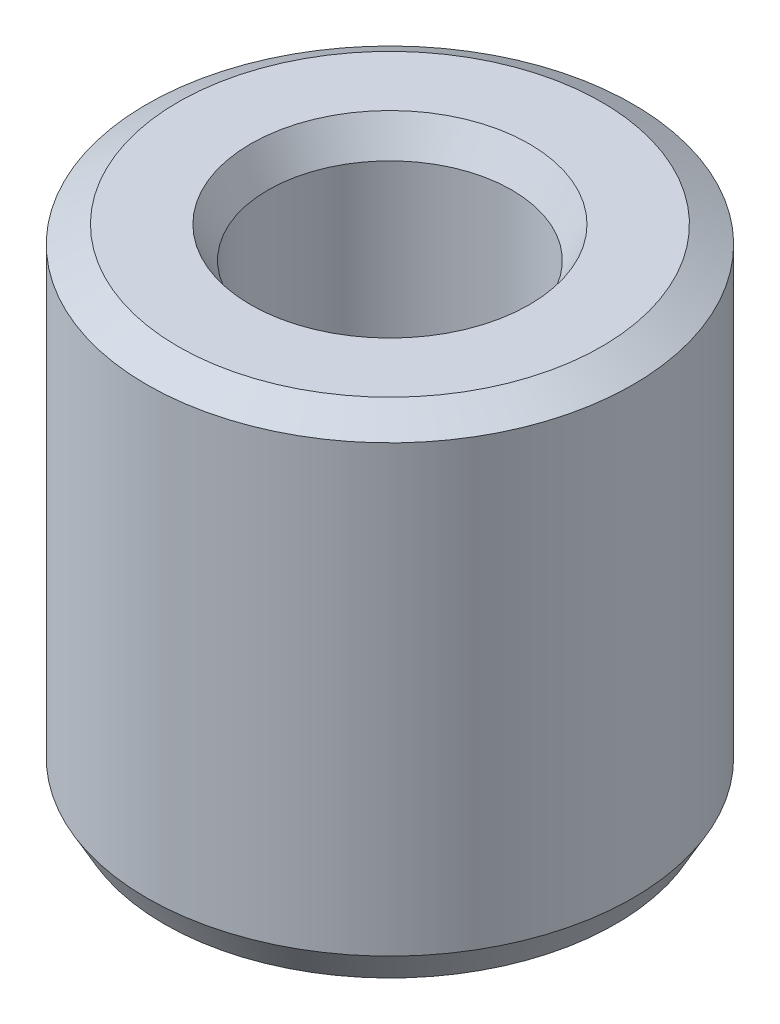
ISO-10303-21;
HEADER;
FILE_DESCRIPTION(('STEP AP214'),'2;1');
FILE_NAME('part.step','',(''),(''),'','','');
FILE_SCHEMA(('AUTOMOTIVE_DESIGN { 1 0 10303 214 1 1 1 1 }'));
ENDSEC;
DATA;
#1=APPLICATION_CONTEXT('core data for automotive mechanical design processes');
#2=APPLICATION_PROTOCOL_DEFINITION('international standard','automotive_design',2000,#1);
#3=PRODUCT_CONTEXT('',#1,'mechanical');
#4=PRODUCT('Part','Part','',(#3));
#5=PRODUCT_RELATED_PRODUCT_CATEGORY('part','',(#4));
#6=PRODUCT_DEFINITION_FORMATION('','',#4);
#7=PRODUCT_DEFINITION_CONTEXT('part definition',#1,'design');
#8=PRODUCT_DEFINITION('design','',#6,#7);
#9=PRODUCT_DEFINITION_SHAPE('','',#8);
#10=(LENGTH_UNIT() NAMED_UNIT(*) SI_UNIT(.MILLI.,.METRE.));
#11=(NAMED_UNIT(*) PLANE_ANGLE_UNIT() SI_UNIT($,.RADIAN.));
#12=(NAMED_UNIT(*) SI_UNIT($,.STERADIAN.) SOLID_ANGLE_UNIT());
#13=UNCERTAINTY_MEASURE_WITH_UNIT(LENGTH_MEASURE(1.E-05),#10,'distance_accuracy_value','');
#14=(GEOMETRIC_REPRESENTATION_CONTEXT(3) GLOBAL_UNCERTAINTY_ASSIGNED_CONTEXT((#13)) GLOBAL_UNIT_ASSIGNED_CONTEXT((#10,
#11,#12)) REPRESENTATION_CONTEXT('',''));
#15=CARTESIAN_POINT('',(0.,0.,0.));
#16=DIRECTION('',(0.,0.,1.));
#17=DIRECTION('',(1.,0.,0.));
#18=AXIS2_PLACEMENT_3D('',#15,#16,#17);
#19=CARTESIAN_POINT('',(0.,101.469136186512,0.));
#20=DIRECTION('',(0.,-1.,0.));
#21=DIRECTION('',(0.,0.,-1.));
#22=AXIS2_PLACEMENT_3D('',#19,#20,#21);
#23=CYLINDRICAL_SURFACE('',#22,50.);
#24=CARTESIAN_POINT('',(0.,6.42921951662753,0.));
#25=DIRECTION('',(0.,1.,0.));
#26=DIRECTION('',(0.,0.,1.));
#27=AXIS2_PLACEMENT_3D('',#24,#25,#26);
#28=CIRCLE('',#27,50.);
#29=CARTESIAN_POINT('',(0.,6.42921951662753,50.));
#30=VERTEX_POINT('',#29);
#31=EDGE_CURVE('E10',#30,#30,#28,.T.);
#32=ORIENTED_EDGE('',*,*,#31,.T.);
#33=EDGE_LOOP('',(#32));
#34=FACE_BOUND('',#33,.T.);
#35=CARTESIAN_POINT('',(0.,97.8813860416298,0.));
#36=DIRECTION('',(0.,1.,0.));
#37=DIRECTION('',(0.,0.,1.));
#38=AXIS2_PLACEMENT_3D('',#35,#36,#37);
#39=CIRCLE('',#38,50.);
#40=CARTESIAN_POINT('',(0.,97.8813860416298,50.));
#41=VERTEX_POINT('',#40);
#42=EDGE_CURVE('E50',#41,#41,#39,.F.);
#43=ORIENTED_EDGE('',*,*,#42,.T.);
#44=EDGE_LOOP('',(#43));
#45=FACE_BOUND('',#44,.T.);
#46=ADVANCED_FACE('F39',(#34,#45),#23,.T.);
#47=CARTESIAN_POINT('',(0.,101.469136186512,0.));
#48=DIRECTION('',(0.,1.,0.));
#49=DIRECTION('',(0.,0.,1.));
#50=AXIS2_PLACEMENT_3D('',#47,#48,#49);
#51=PLANE('',#50);
#52=CARTESIAN_POINT('',(0.,101.469136186512,0.));
#53=DIRECTION('',(0.,1.,0.));
#54=DIRECTION('',(0.,0.,1.));
#55=AXIS2_PLACEMENT_3D('',#52,#53,#54);
#56=CIRCLE('',#55,28.6722981224848);
#57=CARTESIAN_POINT('',(0.,101.469136186512,28.6722981224848));
#58=VERTEX_POINT('',#57);
#59=EDGE_CURVE('E58',#58,#58,#56,.F.);
#60=ORIENTED_EDGE('',*,*,#59,.T.);
#61=EDGE_LOOP('',(#60));
#62=FACE_BOUND('',#61,.T.);
#63=CARTESIAN_POINT('',(0.,101.469136186512,0.));
#64=DIRECTION('',(0.,1.,0.));
#65=DIRECTION('',(0.,0.,1.));
#66=AXIS2_PLACEMENT_3D('',#63,#64,#65);
#67=CIRCLE('',#66,43.5707804833724);
#68=CARTESIAN_POINT('',(0.,101.469136186512,43.5707804833724));
#69=VERTEX_POINT('',#68);
#70=EDGE_CURVE('E61',#69,#69,#67,.T.);
#71=ORIENTED_EDGE('',*,*,#70,.T.);
#72=EDGE_LOOP('',(#71));
#73=FACE_BOUND('',#72,.T.);
#74=ADVANCED_FACE('F88',(#62,#73),#51,.T.);
#75=CARTESIAN_POINT('',(0.,0.,0.));
#76=DIRECTION('',(0.,1.,0.));
#77=DIRECTION('',(0.,0.,1.));
#78=AXIS2_PLACEMENT_3D('',#75,#76,#77);
#79=PLANE('',#78);
#80=CARTESIAN_POINT('',(0.,0.,0.));
#81=DIRECTION('',(0.,1.,0.));
#82=DIRECTION('',(0.,0.,1.));
#83=AXIS2_PLACEMENT_3D('',#80,#81,#82);
#84=CIRCLE('',#83,31.5137674942298);
#85=CARTESIAN_POINT('',(0.,0.,31.5137674942298));
#86=VERTEX_POINT('',#85);
#87=EDGE_CURVE('E51',#86,#86,#84,.T.);
#88=ORIENTED_EDGE('',*,*,#87,.T.);
#89=EDGE_LOOP('',(#88));
#90=FACE_BOUND('',#89,.T.);
#91=CARTESIAN_POINT('',(0.,0.,0.));
#92=DIRECTION('',(0.,1.,0.));
#93=DIRECTION('',(0.,0.,1.));
#94=AXIS2_PLACEMENT_3D('',#91,#92,#93);
#95=CIRCLE('',#94,46.4122498551175);
#96=CARTESIAN_POINT('',(0.,0.,46.4122498551175));
#97=VERTEX_POINT('',#96);
#98=EDGE_CURVE('E54',#97,#97,#95,.F.);
#99=ORIENTED_EDGE('',*,*,#98,.T.);
#100=EDGE_LOOP('',(#99));
#101=FACE_BOUND('',#100,.T.);
#102=ADVANCED_FACE('F83',(#90,#101),#79,.F.);
#103=CARTESIAN_POINT('',(0.,101.469136186512,0.));
#104=DIRECTION('',(0.,-1.,0.));
#105=DIRECTION('',(0.,0.,-1.));
#106=AXIS2_PLACEMENT_3D('',#103,#104,#105);
#107=CYLINDRICAL_SURFACE('',#106,25.0845479776022);
#108=CARTESIAN_POINT('',(0.,95.0399166698847,0.));
#109=DIRECTION('',(0.,1.,0.));
#110=DIRECTION('',(0.,0.,1.));
#111=AXIS2_PLACEMENT_3D('',#108,#109,#110);
#112=CIRCLE('',#111,25.0845479776022);
#113=CARTESIAN_POINT('',(0.,95.0399166698847,25.0845479776022));
#114=VERTEX_POINT('',#113);
#115=EDGE_CURVE('E67',#114,#114,#112,.T.);
#116=ORIENTED_EDGE('',*,*,#115,.T.);
#117=EDGE_LOOP('',(#116));
#118=FACE_BOUND('',#117,.T.);
#119=CARTESIAN_POINT('',(0.,3.58775014488256,0.));
#120=DIRECTION('',(0.,1.,0.));
#121=DIRECTION('',(0.,0.,1.));
#122=AXIS2_PLACEMENT_3D('',#119,#120,#121);
#123=CIRCLE('',#122,25.0845479776022);
#124=CARTESIAN_POINT('',(0.,3.58775014488256,25.0845479776022));
#125=VERTEX_POINT('',#124);
#126=EDGE_CURVE('E69',#125,#125,#123,.F.);
#127=ORIENTED_EDGE('',*,*,#126,.T.);
#128=EDGE_LOOP('',(#127));
#129=FACE_BOUND('',#128,.T.);
#130=ADVANCED_FACE('F71',(#118,#129),#107,.F.);
#131=CARTESIAN_POINT('',(0.,95.0399166698847,0.));
#132=DIRECTION('',(0.,1.,0.));
#133=DIRECTION('',(0.,0.,1.));
#134=AXIS2_PLACEMENT_3D('',#131,#132,#133);
#135=CONICAL_SURFACE('',#134,25.0845479776022,0.508993626782023);
#136=CARTESIAN_POINT('',(0.,101.469136186512,28.6722981224848));
#137=CARTESIAN_POINT('',(0.,101.402165149881,28.6349257251423));
#138=CARTESIAN_POINT('',(0.,101.335194113249,28.5975533277998));
#139=CARTESIAN_POINT('',(0.,101.201252039986,28.5228085331147));
#140=CARTESIAN_POINT('',(0.,101.134281003355,28.4854361357722));
#141=CARTESIAN_POINT('',(0.,101.000338930092,28.4106913410871));
#142=CARTESIAN_POINT('',(0.,100.93336789346,28.3733189437446));
#143=CARTESIAN_POINT('',(0.,100.799425820197,28.2985741490595));
#144=CARTESIAN_POINT('',(0.,100.732454783565,28.261201751717));
#145=CARTESIAN_POINT('',(0.,100.598512710302,28.186456957032));
#146=CARTESIAN_POINT('',(0.,100.531541673671,28.1490845596894));
#147=CARTESIAN_POINT('',(0.,100.397599600408,28.0743397650044));
#148=CARTESIAN_POINT('',(0.,100.330628563776,28.0369673676618));
#149=CARTESIAN_POINT('',(0.,100.196686490513,27.9622225729768));
#150=CARTESIAN_POINT('',(0.,100.129715453882,27.9248501756343));
#151=CARTESIAN_POINT('',(0.,99.9957733806185,27.8501053809492));
#152=CARTESIAN_POINT('',(0.,99.928802343987,27.8127329836067));
#153=CARTESIAN_POINT('',(0.,99.7948602707239,27.7379881889216));
#154=CARTESIAN_POINT('',(0.,99.7278892340924,27.7006157915791));
#155=CARTESIAN_POINT('',(0.,99.5939471608293,27.6258709968941));
#156=CARTESIAN_POINT('',(0.,99.5269761241978,27.5884985995515));
#157=CARTESIAN_POINT('',(0.,99.3930340509347,27.5137538048665));
#158=CARTESIAN_POINT('',(0.,99.3260630143031,27.4763814075239));
#159=CARTESIAN_POINT('',(0.,99.1921209410401,27.4016366128389));
#160=CARTESIAN_POINT('',(0.,99.1251499044085,27.3642642154964));
#161=CARTESIAN_POINT('',(0.,98.9912078311455,27.2895194208113));
#162=CARTESIAN_POINT('',(0.,98.9242367945139,27.2521470234688));
#163=CARTESIAN_POINT('',(0.,98.7902947212508,27.1774022287837));
#164=CARTESIAN_POINT('',(0.,98.7233236846193,27.1400298314412));
#165=CARTESIAN_POINT('',(0.,98.5893816113562,27.0652850367561));
#166=CARTESIAN_POINT('',(0.,98.5224105747247,27.0279126394136));
#167=CARTESIAN_POINT('',(0.,98.3884685014616,26.9531678447286));
#168=CARTESIAN_POINT('',(0.,98.3214974648301,26.915795447386));
#169=CARTESIAN_POINT('',(0.,98.187555391567,26.841050652701));
#170=CARTESIAN_POINT('',(0.,98.1205843549355,26.8036782553585));
#171=CARTESIAN_POINT('',(0.,97.9866422816724,26.7289334606734));
#172=CARTESIAN_POINT('',(0.,97.9196712450408,26.6915610633309));
#173=CARTESIAN_POINT('',(0.,97.7857291717778,26.6168162686458));
#174=CARTESIAN_POINT('',(0.,97.7187581351462,26.5794438713033));
#175=CARTESIAN_POINT('',(0.,97.5848160618832,26.5046990766182));
#176=CARTESIAN_POINT('',(0.,97.5178450252516,26.4673266792757));
#177=CARTESIAN_POINT('',(0.,97.3839029519885,26.3925818845907));
#178=CARTESIAN_POINT('',(0.,97.316931915357,26.3552094872481));
#179=CARTESIAN_POINT('',(0.,97.1829898420939,26.2804646925631));
#180=CARTESIAN_POINT('',(0.,97.1160188054624,26.2430922952205));
#181=CARTESIAN_POINT('',(0.,96.9820767321993,26.1683475005355));
#182=CARTESIAN_POINT('',(0.,96.9151056955678,26.130975103193));
#183=CARTESIAN_POINT('',(0.,96.7811636223047,26.0562303085079));
#184=CARTESIAN_POINT('',(0.,96.7141925856732,26.0188579111654));
#185=CARTESIAN_POINT('',(0.,96.5802505124101,25.9441131164803));
#186=CARTESIAN_POINT('',(0.,96.5132794757786,25.9067407191378));
#187=CARTESIAN_POINT('',(0.,96.3793374025155,25.8319959244527));
#188=CARTESIAN_POINT('',(0.,96.3123663658839,25.7946235271102));
#189=CARTESIAN_POINT('',(0.,96.1784242926209,25.7198787324252));
#190=CARTESIAN_POINT('',(0.,96.1114532559893,25.6825063350826));
#191=CARTESIAN_POINT('',(0.,95.9775111827262,25.6077615403976));
#192=CARTESIAN_POINT('',(0.,95.9105401460947,25.5703891430551));
#193=CARTESIAN_POINT('',(0.,95.7765980728316,25.49564434837));
#194=CARTESIAN_POINT('',(0.,95.7096270362001,25.4582719510275));
#195=CARTESIAN_POINT('',(0.,95.575684962937,25.3835271563424));
#196=CARTESIAN_POINT('',(0.,95.5087139263055,25.3461547589999));
#197=CARTESIAN_POINT('',(0.,95.3747718530424,25.2714099643148));
#198=CARTESIAN_POINT('',(0.,95.3078008164109,25.2340375669723));
#199=CARTESIAN_POINT('',(0.,95.1738587431478,25.1592927722873));
#200=CARTESIAN_POINT('',(0.,95.1068877065163,25.1219203749447));
#201=CARTESIAN_POINT('',(0.,95.0399166698847,25.0845479776022));
#202=B_SPLINE_CURVE_WITH_KNOTS('',3,(#136,#137,#138,#139,#140,#141,#142,#143,#144,#145,#146,
#147,#148,#149,#150,#151,#152,#153,#154,#155,#156,#157,#158,#159,#160,#161,#162,#163,#164,#165,
#166,#167,#168,#169,#170,#171,#172,#173,#174,#175,#176,#177,#178,#179,#180,#181,#182,#183,#184,
#185,#186,#187,#188,#189,#190,#191,#192,#193,#194,#195,#196,#197,#198,#199,#200,#201),
.UNSPECIFIED.,.F.,.F.,(4,2,2,2,2,2,2,2,2,2,2,2,2,2,2,2,2,2,2,2,2,2,2,2,2,2,2,2,2,2,2,2,4),(0.,
0.230078991817324,0.460157983634649,0.690236975451961,0.920315967269286,1.15039495908661,
1.38047395090392,1.61055294272125,1.84063193453857,2.07071092635588,2.30078991817321,
2.53086890999053,2.76094790180785,2.99102689362517,3.2211058854425,3.45118487725981,
3.68126386907713,3.91134286089446,4.14142185271177,4.37150084452909,4.60157983634642,
4.83165882816373,5.06173781998105,5.29181681179838,5.52189580361569,5.75197479543302,
5.98205378725034,6.21213277906765,6.44221177088498,6.6722907627023,6.90236975451961,
7.13244874633694,7.36252773815425),.UNSPECIFIED.);
#203=EDGE_CURVE('BSEAM77',#58,#114,#202,.T.);
#204=ORIENTED_EDGE('',*,*,#59,.F.);
#205=ORIENTED_EDGE('',*,*,#115,.F.);
#206=ORIENTED_EDGE('',*,*,#203,.T.);
#207=ORIENTED_EDGE('',*,*,#203,.F.);
#208=EDGE_LOOP('',(#204,#206,#205,#207));
#209=FACE_BOUND('',#208,.T.);
#210=ADVANCED_FACE('F77',(#209),#135,.F.);
#211=CARTESIAN_POINT('',(0.,0.,0.));
#212=DIRECTION('',(0.,-1.,0.));
#213=DIRECTION('',(0.,0.,-1.));
#214=AXIS2_PLACEMENT_3D('',#211,#212,#213);
#215=CONICAL_SURFACE('',#214,31.5137674942298,1.06180270001288);
#216=ORIENTED_EDGE('',*,*,#126,.F.);
#217=EDGE_LOOP('',(#216));
#218=FACE_BOUND('',#217,.T.);
#219=ORIENTED_EDGE('',*,*,#87,.F.);
#220=EDGE_LOOP('',(#219));
#221=FACE_BOUND('',#220,.T.);
#222=ADVANCED_FACE('F73',(#218,#221),#215,.F.);
#223=CARTESIAN_POINT('',(0.,6.42921951662753,0.));
#224=DIRECTION('',(0.,1.,0.));
#225=DIRECTION('',(0.,0.,1.));
#226=AXIS2_PLACEMENT_3D('',#223,#224,#225);
#227=CONICAL_SURFACE('',#226,50.,0.508993626782022);
#228=ORIENTED_EDGE('',*,*,#98,.F.);
#229=EDGE_LOOP('',(#228));
#230=FACE_BOUND('',#229,.T.);
#231=ORIENTED_EDGE('',*,*,#31,.F.);
#232=EDGE_LOOP('',(#231));
#233=FACE_BOUND('',#232,.T.);
#234=ADVANCED_FACE('F76',(#230,#233),#227,.T.);
#235=CARTESIAN_POINT('',(0.,101.469136186512,0.));
#236=DIRECTION('',(0.,-1.,0.));
#237=DIRECTION('',(0.,0.,-1.));
#238=AXIS2_PLACEMENT_3D('',#235,#236,#237);
#239=CONICAL_SURFACE('',#238,43.5707804833724,1.06180270001287);
#240=ORIENTED_EDGE('',*,*,#42,.F.);
#241=EDGE_LOOP('',(#240));
#242=FACE_BOUND('',#241,.T.);
#243=ORIENTED_EDGE('',*,*,#70,.F.);
#244=EDGE_LOOP('',(#243));
#245=FACE_BOUND('',#244,.T.);
#246=ADVANCED_FACE('F45',(#242,#245),#239,.T.);
#247=CLOSED_SHELL('',(#46,#74,#102,#130,#210,#222,#234,#246));
#248=MANIFOLD_SOLID_BREP('B2',#247);
#249=ADVANCED_BREP_SHAPE_REPRESENTATION('',(#18,#248),#14);
#250=SHAPE_DEFINITION_REPRESENTATION(#9,#249);
ENDSEC;
END-ISO-10303-21;
